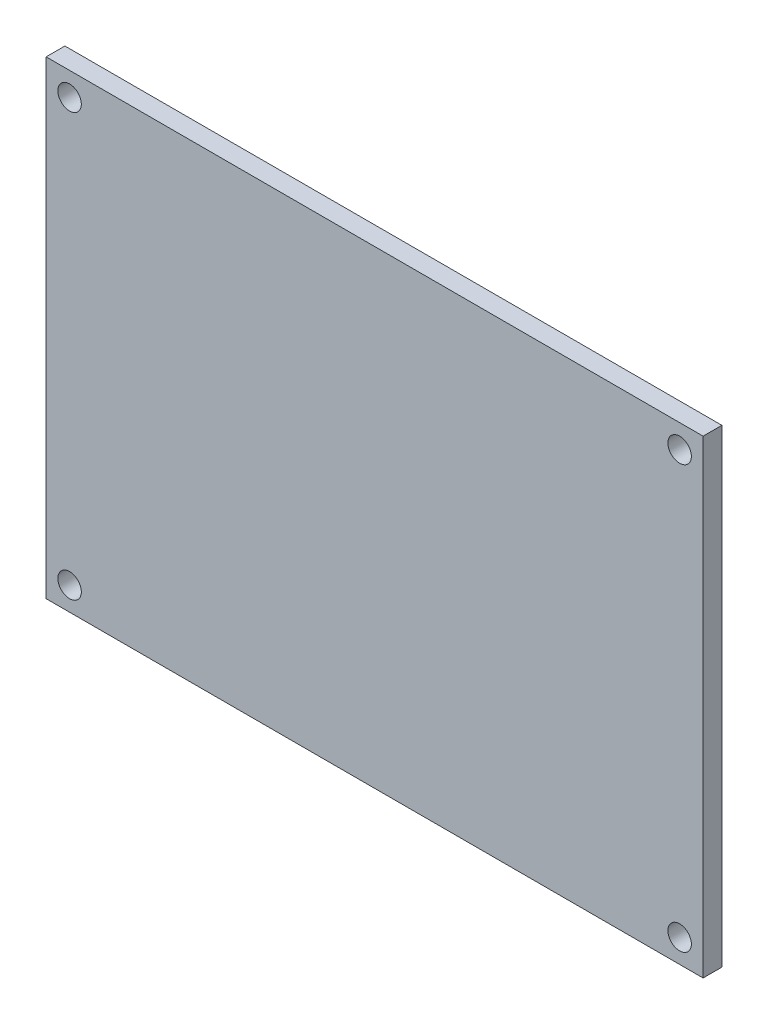
ISO-10303-21;
HEADER;
FILE_DESCRIPTION(('STEP AP214'),'2;1');
FILE_NAME('part.step','',(''),(''),'','','');
FILE_SCHEMA(('AUTOMOTIVE_DESIGN { 1 0 10303 214 1 1 1 1 }'));
ENDSEC;
DATA;
#1=APPLICATION_CONTEXT('core data for automotive mechanical design processes');
#2=APPLICATION_PROTOCOL_DEFINITION('international standard','automotive_design',2000,#1);
#3=PRODUCT_CONTEXT('',#1,'mechanical');
#4=PRODUCT('Part','Part','',(#3));
#5=PRODUCT_RELATED_PRODUCT_CATEGORY('part','',(#4));
#6=PRODUCT_DEFINITION_FORMATION('','',#4);
#7=PRODUCT_DEFINITION_CONTEXT('part definition',#1,'design');
#8=PRODUCT_DEFINITION('design','',#6,#7);
#9=PRODUCT_DEFINITION_SHAPE('','',#8);
#10=(LENGTH_UNIT() NAMED_UNIT(*) SI_UNIT(.MILLI.,.METRE.));
#11=(NAMED_UNIT(*) PLANE_ANGLE_UNIT() SI_UNIT($,.RADIAN.));
#12=(NAMED_UNIT(*) SI_UNIT($,.STERADIAN.) SOLID_ANGLE_UNIT());
#13=UNCERTAINTY_MEASURE_WITH_UNIT(LENGTH_MEASURE(1.E-05),#10,'distance_accuracy_value','');
#14=(GEOMETRIC_REPRESENTATION_CONTEXT(3) GLOBAL_UNCERTAINTY_ASSIGNED_CONTEXT((#13)) GLOBAL_UNIT_ASSIGNED_CONTEXT((#10,
#11,#12)) REPRESENTATION_CONTEXT('',''));
#15=CARTESIAN_POINT('',(0.,0.,0.));
#16=DIRECTION('',(0.,0.,1.));
#17=DIRECTION('',(1.,0.,0.));
#18=AXIS2_PLACEMENT_3D('',#15,#16,#17);
#19=CARTESIAN_POINT('',(0.,0.,4.));
#20=DIRECTION('',(0.,0.,1.));
#21=DIRECTION('',(1.,0.,0.));
#22=AXIS2_PLACEMENT_3D('',#19,#20,#21);
#23=PLANE('',#22);
#24=CARTESIAN_POINT('',(-92.1813725490196,-51.6053921568627,4.));
#25=DIRECTION('',(0.,0.,1.));
#26=DIRECTION('',(1.,0.,0.));
#27=AXIS2_PLACEMENT_3D('',#24,#25,#26);
#28=CIRCLE('',#27,2.5);
#29=CARTESIAN_POINT('',(-89.6813725490196,-51.6053921568627,4.));
#30=VERTEX_POINT('',#29);
#31=EDGE_CURVE('E114',#30,#30,#28,.T.);
#32=ORIENTED_EDGE('',*,*,#31,.F.);
#33=EDGE_LOOP('',(#32));
#34=FACE_BOUND('',#33,.T.);
#35=CARTESIAN_POINT('',(37.8186274509804,38.3946078431373,4.));
#36=DIRECTION('',(0.,0.,1.));
#37=DIRECTION('',(1.,0.,0.));
#38=AXIS2_PLACEMENT_3D('',#35,#36,#37);
#39=CIRCLE('',#38,2.5);
#40=CARTESIAN_POINT('',(40.3186274509804,38.3946078431373,4.));
#41=VERTEX_POINT('',#40);
#42=EDGE_CURVE('E126',#41,#41,#39,.T.);
#43=ORIENTED_EDGE('',*,*,#42,.F.);
#44=EDGE_LOOP('',(#43));
#45=FACE_BOUND('',#44,.T.);
#46=CARTESIAN_POINT('',(-92.1813725490196,38.3946078431373,4.));
#47=DIRECTION('',(0.,0.,1.));
#48=DIRECTION('',(1.,0.,0.));
#49=AXIS2_PLACEMENT_3D('',#46,#47,#48);
#50=CIRCLE('',#49,2.50000000000002);
#51=CARTESIAN_POINT('',(-89.6813725490196,38.3946078431373,4.));
#52=VERTEX_POINT('',#51);
#53=EDGE_CURVE('E11',#52,#52,#50,.T.);
#54=ORIENTED_EDGE('',*,*,#53,.F.);
#55=EDGE_LOOP('',(#54));
#56=FACE_BOUND('',#55,.T.);
#57=CARTESIAN_POINT('',(37.8186274509804,-51.6053921568627,4.));
#58=DIRECTION('',(0.,0.,1.));
#59=DIRECTION('',(1.,0.,0.));
#60=AXIS2_PLACEMENT_3D('',#57,#58,#59);
#61=CIRCLE('',#60,2.5);
#62=CARTESIAN_POINT('',(40.3186274509804,-51.6053921568627,4.));
#63=VERTEX_POINT('',#62);
#64=EDGE_CURVE('E120',#63,#63,#61,.T.);
#65=ORIENTED_EDGE('',*,*,#64,.F.);
#66=EDGE_LOOP('',(#65));
#67=FACE_BOUND('',#66,.T.);
#68=DIRECTION('',(0.,1.,0.));
#69=VECTOR('',#68,1.);
#70=CARTESIAN_POINT('',(42.8186274509804,43.3946078431373,4.));
#71=LINE('',#70,#69);
#72=CARTESIAN_POINT('',(42.8186274509804,-56.6053921568627,4.));
#73=VERTEX_POINT('',#72);
#74=CARTESIAN_POINT('',(42.8186274509804,43.3946078431373,4.));
#75=VERTEX_POINT('',#74);
#76=EDGE_CURVE('E86',#73,#75,#71,.T.);
#77=ORIENTED_EDGE('',*,*,#76,.T.);
#78=DIRECTION('',(-1.,0.,0.));
#79=VECTOR('',#78,1.);
#80=CARTESIAN_POINT('',(-97.1813725490196,43.3946078431373,4.));
#81=LINE('',#80,#79);
#82=CARTESIAN_POINT('',(-97.1813725490196,43.3946078431373,4.));
#83=VERTEX_POINT('',#82);
#84=EDGE_CURVE('E103',#75,#83,#81,.T.);
#85=ORIENTED_EDGE('',*,*,#84,.T.);
#86=DIRECTION('',(0.,-1.,0.));
#87=VECTOR('',#86,1.);
#88=CARTESIAN_POINT('',(-97.1813725490196,43.3946078431373,4.));
#89=LINE('',#88,#87);
#90=CARTESIAN_POINT('',(-97.1813725490196,-56.6053921568627,4.));
#91=VERTEX_POINT('',#90);
#92=EDGE_CURVE('E106',#83,#91,#89,.T.);
#93=ORIENTED_EDGE('',*,*,#92,.T.);
#94=DIRECTION('',(1.,0.,0.));
#95=VECTOR('',#94,1.);
#96=CARTESIAN_POINT('',(-97.1813725490196,-56.6053921568627,4.));
#97=LINE('',#96,#95);
#98=EDGE_CURVE('E54',#91,#73,#97,.T.);
#99=ORIENTED_EDGE('',*,*,#98,.T.);
#100=EDGE_LOOP('',(#77,#85,#93,#99));
#101=FACE_BOUND('',#100,.T.);
#102=ADVANCED_FACE('F39',(#34,#45,#56,#67,#101),#23,.T.);
#103=CARTESIAN_POINT('',(0.,0.,0.));
#104=DIRECTION('',(0.,0.,1.));
#105=DIRECTION('',(1.,0.,0.));
#106=AXIS2_PLACEMENT_3D('',#103,#104,#105);
#107=PLANE('',#106);
#108=CARTESIAN_POINT('',(-92.1813725490196,-51.6053921568627,0.));
#109=DIRECTION('',(0.,0.,1.));
#110=DIRECTION('',(1.,0.,0.));
#111=AXIS2_PLACEMENT_3D('',#108,#109,#110);
#112=CIRCLE('',#111,2.5);
#113=CARTESIAN_POINT('',(-89.6813725490196,-51.6053921568627,0.));
#114=VERTEX_POINT('',#113);
#115=EDGE_CURVE('E111',#114,#114,#112,.T.);
#116=ORIENTED_EDGE('',*,*,#115,.T.);
#117=EDGE_LOOP('',(#116));
#118=FACE_BOUND('',#117,.T.);
#119=CARTESIAN_POINT('',(37.8186274509804,-51.6053921568627,0.));
#120=DIRECTION('',(0.,0.,1.));
#121=DIRECTION('',(1.,0.,0.));
#122=AXIS2_PLACEMENT_3D('',#119,#120,#121);
#123=CIRCLE('',#122,2.5);
#124=CARTESIAN_POINT('',(40.3186274509804,-51.6053921568627,0.));
#125=VERTEX_POINT('',#124);
#126=EDGE_CURVE('E117',#125,#125,#123,.T.);
#127=ORIENTED_EDGE('',*,*,#126,.T.);
#128=EDGE_LOOP('',(#127));
#129=FACE_BOUND('',#128,.T.);
#130=CARTESIAN_POINT('',(37.8186274509804,38.3946078431373,0.));
#131=DIRECTION('',(0.,0.,1.));
#132=DIRECTION('',(1.,0.,0.));
#133=AXIS2_PLACEMENT_3D('',#130,#131,#132);
#134=CIRCLE('',#133,2.5);
#135=CARTESIAN_POINT('',(40.3186274509804,38.3946078431373,0.));
#136=VERTEX_POINT('',#135);
#137=EDGE_CURVE('E123',#136,#136,#134,.T.);
#138=ORIENTED_EDGE('',*,*,#137,.T.);
#139=EDGE_LOOP('',(#138));
#140=FACE_BOUND('',#139,.T.);
#141=CARTESIAN_POINT('',(-92.1813725490196,38.3946078431373,0.));
#142=DIRECTION('',(0.,0.,1.));
#143=DIRECTION('',(1.,0.,0.));
#144=AXIS2_PLACEMENT_3D('',#141,#142,#143);
#145=CIRCLE('',#144,2.50000000000002);
#146=CARTESIAN_POINT('',(-89.6813725490196,38.3946078431373,0.));
#147=VERTEX_POINT('',#146);
#148=EDGE_CURVE('E43',#147,#147,#145,.T.);
#149=ORIENTED_EDGE('',*,*,#148,.T.);
#150=EDGE_LOOP('',(#149));
#151=FACE_BOUND('',#150,.T.);
#152=DIRECTION('',(-1.,0.,0.));
#153=VECTOR('',#152,1.);
#154=CARTESIAN_POINT('',(-97.1813725490196,43.3946078431373,0.));
#155=LINE('',#154,#153);
#156=CARTESIAN_POINT('',(42.8186274509804,43.3946078431373,0.));
#157=VERTEX_POINT('',#156);
#158=CARTESIAN_POINT('',(-97.1813725490196,43.3946078431373,0.));
#159=VERTEX_POINT('',#158);
#160=EDGE_CURVE('E62',#157,#159,#155,.T.);
#161=ORIENTED_EDGE('',*,*,#160,.F.);
#162=DIRECTION('',(0.,1.,0.));
#163=VECTOR('',#162,1.);
#164=CARTESIAN_POINT('',(42.8186274509804,43.3946078431373,0.));
#165=LINE('',#164,#163);
#166=CARTESIAN_POINT('',(42.8186274509804,-56.6053921568627,0.));
#167=VERTEX_POINT('',#166);
#168=EDGE_CURVE('E84',#167,#157,#165,.T.);
#169=ORIENTED_EDGE('',*,*,#168,.F.);
#170=DIRECTION('',(1.,0.,0.));
#171=VECTOR('',#170,1.);
#172=CARTESIAN_POINT('',(-97.1813725490196,-56.6053921568627,0.));
#173=LINE('',#172,#171);
#174=CARTESIAN_POINT('',(-97.1813725490196,-56.6053921568627,0.));
#175=VERTEX_POINT('',#174);
#176=EDGE_CURVE('E91',#175,#167,#173,.T.);
#177=ORIENTED_EDGE('',*,*,#176,.F.);
#178=DIRECTION('',(0.,-1.,0.));
#179=VECTOR('',#178,1.);
#180=CARTESIAN_POINT('',(-97.1813725490196,43.3946078431373,0.));
#181=LINE('',#180,#179);
#182=EDGE_CURVE('E96',#159,#175,#181,.T.);
#183=ORIENTED_EDGE('',*,*,#182,.F.);
#184=EDGE_LOOP('',(#161,#169,#177,#183));
#185=FACE_BOUND('',#184,.T.);
#186=ADVANCED_FACE('F41',(#118,#129,#140,#151,#185),#107,.F.);
#187=CARTESIAN_POINT('',(-92.1813725490196,38.3946078431373,4.));
#188=DIRECTION('',(0.,0.,-1.));
#189=DIRECTION('',(-1.,0.,0.));
#190=AXIS2_PLACEMENT_3D('',#187,#188,#189);
#191=CYLINDRICAL_SURFACE('',#190,2.50000000000002);
#192=ORIENTED_EDGE('',*,*,#53,.T.);
#193=EDGE_LOOP('',(#192));
#194=FACE_BOUND('',#193,.T.);
#195=ORIENTED_EDGE('',*,*,#148,.F.);
#196=EDGE_LOOP('',(#195));
#197=FACE_BOUND('',#196,.T.);
#198=ADVANCED_FACE('F137',(#194,#197),#191,.F.);
#199=CARTESIAN_POINT('',(37.8186274509804,38.3946078431373,4.));
#200=DIRECTION('',(0.,0.,-1.));
#201=DIRECTION('',(-1.,0.,0.));
#202=AXIS2_PLACEMENT_3D('',#199,#200,#201);
#203=CYLINDRICAL_SURFACE('',#202,2.5);
#204=ORIENTED_EDGE('',*,*,#42,.T.);
#205=EDGE_LOOP('',(#204));
#206=FACE_BOUND('',#205,.T.);
#207=ORIENTED_EDGE('',*,*,#137,.F.);
#208=EDGE_LOOP('',(#207));
#209=FACE_BOUND('',#208,.T.);
#210=ADVANCED_FACE('F134',(#206,#209),#203,.F.);
#211=CARTESIAN_POINT('',(37.8186274509804,-51.6053921568627,4.));
#212=DIRECTION('',(0.,0.,-1.));
#213=DIRECTION('',(-1.,0.,0.));
#214=AXIS2_PLACEMENT_3D('',#211,#212,#213);
#215=CYLINDRICAL_SURFACE('',#214,2.5);
#216=ORIENTED_EDGE('',*,*,#64,.T.);
#217=EDGE_LOOP('',(#216));
#218=FACE_BOUND('',#217,.T.);
#219=ORIENTED_EDGE('',*,*,#126,.F.);
#220=EDGE_LOOP('',(#219));
#221=FACE_BOUND('',#220,.T.);
#222=ADVANCED_FACE('F136',(#218,#221),#215,.F.);
#223=CARTESIAN_POINT('',(-92.1813725490196,-51.6053921568627,4.));
#224=DIRECTION('',(0.,0.,-1.));
#225=DIRECTION('',(-1.,0.,0.));
#226=AXIS2_PLACEMENT_3D('',#223,#224,#225);
#227=CYLINDRICAL_SURFACE('',#226,2.5);
#228=ORIENTED_EDGE('',*,*,#31,.T.);
#229=EDGE_LOOP('',(#228));
#230=FACE_BOUND('',#229,.T.);
#231=ORIENTED_EDGE('',*,*,#115,.F.);
#232=EDGE_LOOP('',(#231));
#233=FACE_BOUND('',#232,.T.);
#234=ADVANCED_FACE('F144',(#230,#233),#227,.F.);
#235=CARTESIAN_POINT('',(-97.1813725490196,43.3946078431373,0.));
#236=DIRECTION('',(0.,1.,0.));
#237=DIRECTION('',(0.,0.,1.));
#238=AXIS2_PLACEMENT_3D('',#235,#236,#237);
#239=PLANE('',#238);
#240=ORIENTED_EDGE('',*,*,#84,.F.);
#241=DIRECTION('',(0.,0.,1.));
#242=VECTOR('',#241,1.);
#243=CARTESIAN_POINT('',(42.8186274509804,43.3946078431373,0.));
#244=LINE('',#243,#242);
#245=EDGE_CURVE('E87',#157,#75,#244,.T.);
#246=ORIENTED_EDGE('',*,*,#245,.F.);
#247=ORIENTED_EDGE('',*,*,#160,.T.);
#248=DIRECTION('',(0.,0.,1.));
#249=VECTOR('',#248,1.);
#250=CARTESIAN_POINT('',(-97.1813725490196,43.3946078431373,0.));
#251=LINE('',#250,#249);
#252=EDGE_CURVE('E98',#159,#83,#251,.T.);
#253=ORIENTED_EDGE('',*,*,#252,.T.);
#254=EDGE_LOOP('',(#240,#246,#247,#253));
#255=FACE_BOUND('',#254,.T.);
#256=ADVANCED_FACE('F169',(#255),#239,.T.);
#257=CARTESIAN_POINT('',(42.8186274509804,43.3946078431373,0.));
#258=DIRECTION('',(1.,0.,0.));
#259=DIRECTION('',(0.,0.,-1.));
#260=AXIS2_PLACEMENT_3D('',#257,#258,#259);
#261=PLANE('',#260);
#262=ORIENTED_EDGE('',*,*,#76,.F.);
#263=DIRECTION('',(0.,0.,1.));
#264=VECTOR('',#263,1.);
#265=CARTESIAN_POINT('',(42.8186274509804,-56.6053921568627,0.));
#266=LINE('',#265,#264);
#267=EDGE_CURVE('E80',#167,#73,#266,.T.);
#268=ORIENTED_EDGE('',*,*,#267,.F.);
#269=ORIENTED_EDGE('',*,*,#168,.T.);
#270=ORIENTED_EDGE('',*,*,#245,.T.);
#271=EDGE_LOOP('',(#262,#268,#269,#270));
#272=FACE_BOUND('',#271,.T.);
#273=ADVANCED_FACE('F82',(#272),#261,.T.);
#274=CARTESIAN_POINT('',(-97.1813725490196,-56.6053921568627,0.));
#275=DIRECTION('',(0.,-1.,0.));
#276=DIRECTION('',(1.,0.,0.));
#277=AXIS2_PLACEMENT_3D('',#274,#275,#276);
#278=PLANE('',#277);
#279=ORIENTED_EDGE('',*,*,#98,.F.);
#280=DIRECTION('',(0.,0.,1.));
#281=VECTOR('',#280,1.);
#282=CARTESIAN_POINT('',(-97.1813725490196,-56.6053921568627,0.));
#283=LINE('',#282,#281);
#284=EDGE_CURVE('E88',#175,#91,#283,.T.);
#285=ORIENTED_EDGE('',*,*,#284,.F.);
#286=ORIENTED_EDGE('',*,*,#176,.T.);
#287=ORIENTED_EDGE('',*,*,#267,.T.);
#288=EDGE_LOOP('',(#279,#285,#286,#287));
#289=FACE_BOUND('',#288,.T.);
#290=ADVANCED_FACE('F92',(#289),#278,.T.);
#291=CARTESIAN_POINT('',(-97.1813725490196,43.3946078431373,0.));
#292=DIRECTION('',(-1.,0.,0.));
#293=DIRECTION('',(0.,0.,1.));
#294=AXIS2_PLACEMENT_3D('',#291,#292,#293);
#295=PLANE('',#294);
#296=ORIENTED_EDGE('',*,*,#92,.F.);
#297=ORIENTED_EDGE('',*,*,#252,.F.);
#298=ORIENTED_EDGE('',*,*,#182,.T.);
#299=ORIENTED_EDGE('',*,*,#284,.T.);
#300=EDGE_LOOP('',(#296,#297,#298,#299));
#301=FACE_BOUND('',#300,.T.);
#302=ADVANCED_FACE('F167',(#301),#295,.T.);
#303=CLOSED_SHELL('',(#102,#186,#198,#210,#222,#234,#256,#273,#290,#302));
#304=MANIFOLD_SOLID_BREP('B2',#303);
#305=ADVANCED_BREP_SHAPE_REPRESENTATION('',(#18,#304),#14);
#306=SHAPE_DEFINITION_REPRESENTATION(#9,#305);
ENDSEC;
END-ISO-10303-21;
